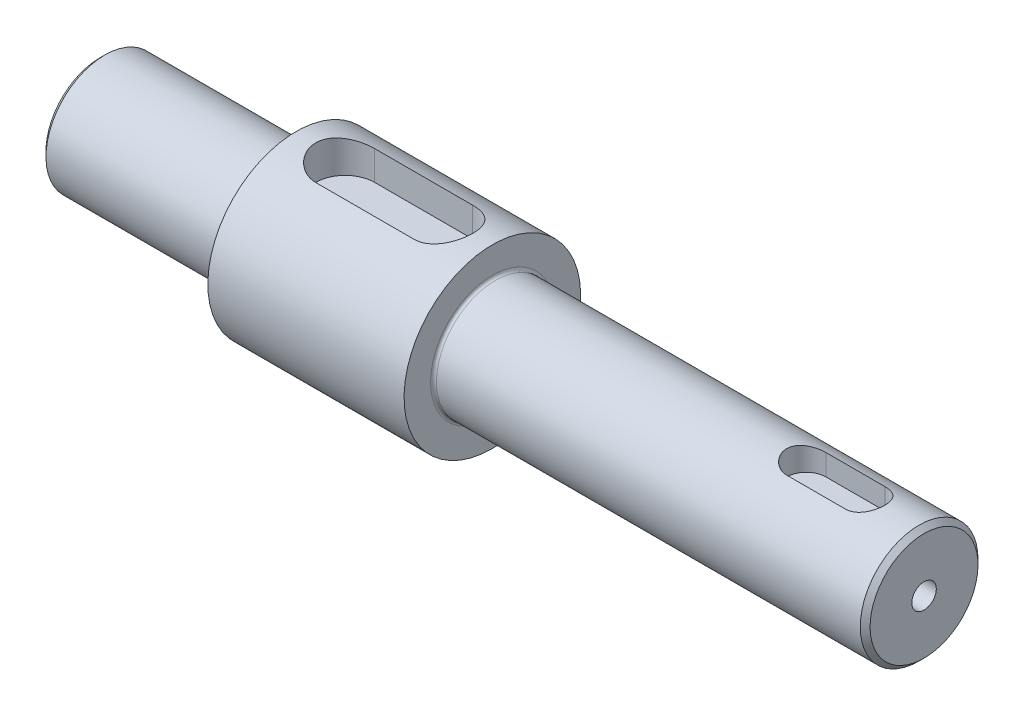
ISO-10303-21;
HEADER;
FILE_DESCRIPTION(('STEP AP214'),'2;1');
FILE_NAME('part.step','',(''),(''),'','','');
FILE_SCHEMA(('AUTOMOTIVE_DESIGN { 1 0 10303 214 1 1 1 1 }'));
ENDSEC;
DATA;
#1=APPLICATION_CONTEXT('core data for automotive mechanical design processes');
#2=APPLICATION_PROTOCOL_DEFINITION('international standard','automotive_design',2000,#1);
#3=PRODUCT_CONTEXT('',#1,'mechanical');
#4=PRODUCT('Part','Part','',(#3));
#5=PRODUCT_RELATED_PRODUCT_CATEGORY('part','',(#4));
#6=PRODUCT_DEFINITION_FORMATION('','',#4);
#7=PRODUCT_DEFINITION_CONTEXT('part definition',#1,'design');
#8=PRODUCT_DEFINITION('design','',#6,#7);
#9=PRODUCT_DEFINITION_SHAPE('','',#8);
#10=(LENGTH_UNIT() NAMED_UNIT(*) SI_UNIT(.MILLI.,.METRE.));
#11=(NAMED_UNIT(*) PLANE_ANGLE_UNIT() SI_UNIT($,.RADIAN.));
#12=(NAMED_UNIT(*) SI_UNIT($,.STERADIAN.) SOLID_ANGLE_UNIT());
#13=UNCERTAINTY_MEASURE_WITH_UNIT(LENGTH_MEASURE(1.E-05),#10,'distance_accuracy_value','');
#14=(GEOMETRIC_REPRESENTATION_CONTEXT(3) GLOBAL_UNCERTAINTY_ASSIGNED_CONTEXT((#13)) GLOBAL_UNIT_ASSIGNED_CONTEXT((#10,
#11,#12)) REPRESENTATION_CONTEXT('',''));
#15=CARTESIAN_POINT('',(0.,0.,0.));
#16=DIRECTION('',(0.,0.,1.));
#17=DIRECTION('',(1.,0.,0.));
#18=AXIS2_PLACEMENT_3D('',#15,#16,#17);
#19=CARTESIAN_POINT('',(-30.,0.,0.));
#20=DIRECTION('',(-1.,0.,0.));
#21=DIRECTION('',(0.,-1.,0.));
#22=AXIS2_PLACEMENT_3D('',#19,#20,#21);
#23=CYLINDRICAL_SURFACE('',#22,5.99999999999999);
#24=CARTESIAN_POINT('',(53.5,0.,0.));
#25=DIRECTION('',(1.,0.,0.));
#26=DIRECTION('',(0.,1.,0.));
#27=AXIS2_PLACEMENT_3D('',#24,#25,#26);
#28=CIRCLE('',#27,5.99999999999999);
#29=CARTESIAN_POINT('',(53.5,5.99999999999999,0.));
#30=VERTEX_POINT('',#29);
#31=EDGE_CURVE('E287',#30,#30,#28,.F.);
#32=ORIENTED_EDGE('',*,*,#31,.T.);
#33=EDGE_LOOP('',(#32));
#34=FACE_BOUND('',#33,.T.);
#35=CARTESIAN_POINT('',(10.3,0.,0.));
#36=DIRECTION('',(-1.,0.,0.));
#37=DIRECTION('',(0.,-1.,0.));
#38=AXIS2_PLACEMENT_3D('',#35,#36,#37);
#39=CIRCLE('',#38,5.99999999999999);
#40=CARTESIAN_POINT('',(10.3,-6.,0.));
#41=VERTEX_POINT('',#40);
#42=EDGE_CURVE('E291',#41,#41,#39,.F.);
#43=ORIENTED_EDGE('',*,*,#42,.T.);
#44=EDGE_LOOP('',(#43));
#45=FACE_BOUND('',#44,.T.);
#46=DIRECTION('',(-1.,0.,0.));
#47=VECTOR('',#46,1.);
#48=CARTESIAN_POINT('',(-30.,5.65685424949237,-1.99999999999998));
#49=LINE('',#48,#47);
#50=CARTESIAN_POINT('',(42.,5.65685424949238,-2.));
#51=VERTEX_POINT('',#50);
#52=CARTESIAN_POINT('',(48.,5.65685424949237,-2.));
#53=VERTEX_POINT('',#52);
#54=EDGE_CURVE('E293',#51,#53,#49,.F.);
#55=ORIENTED_EDGE('',*,*,#54,.T.);
#56=CARTESIAN_POINT('',(48.,5.65685424949237,-2.));
#57=CARTESIAN_POINT('',(48.0545809936022,5.65684884188677,-2.0000014949184));
#58=CARTESIAN_POINT('',(48.1091341243787,5.65764519886489,-1.99776424917479));
#59=CARTESIAN_POINT('',(48.2178171681098,5.66078654578441,-1.9888512140728));
#60=CARTESIAN_POINT('',(48.2719471913194,5.66313111768243,-1.98217662286705));
#61=CARTESIAN_POINT('',(48.4327842863903,5.67238184449301,-1.95562135046158));
#62=CARTESIAN_POINT('',(48.538361692541,5.68150584999029,-1.92920846605623));
#63=CARTESIAN_POINT('',(48.7432503848876,5.70456149397717,-1.85991682366086));
#64=CARTESIAN_POINT('',(48.8425650937458,5.71849047905858,-1.81704715197507));
#65=CARTESIAN_POINT('',(49.0326796680109,5.7495757443892,-1.71614645792974));
#66=CARTESIAN_POINT('',(49.1234742581347,5.76673400456216,-1.65810612564547));
#67=CARTESIAN_POINT('',(49.2974404626491,5.80308960804094,-1.52610278704603));
#68=CARTESIAN_POINT('',(49.3802297609252,5.82233755536617,-1.45164996064408));
#69=CARTESIAN_POINT('',(49.5324120355834,5.86027697385955,-1.28997688598297));
#70=CARTESIAN_POINT('',(49.6018026265119,5.87896834543705,-1.20275436910908));
#71=CARTESIAN_POINT('',(49.7269590376084,5.91427765988454,-1.01520729191253));
#72=CARTESIAN_POINT('',(49.7823219688045,5.93082875123707,-0.914600178716999));
#73=CARTESIAN_POINT('',(49.8751845033745,5.95939217209316,-0.704858499931724));
#74=CARTESIAN_POINT('',(49.9126895636409,5.97140588786618,-0.595726551186846));
#75=CARTESIAN_POINT('',(49.9674714521827,5.98918142285844,-0.37605869095608));
#76=CARTESIAN_POINT('',(49.9854065451074,5.99514617977146,-0.26570366892023));
#77=CARTESIAN_POINT('',(50.0026325970512,6.00087216807633,-0.043397938911351));
#78=CARTESIAN_POINT('',(50.0019279985395,6.00063487762604,0.0685523824907802));
#79=CARTESIAN_POINT('',(49.9823114337867,5.99412077270531,0.28620769055878));
#80=CARTESIAN_POINT('',(49.9641147240811,5.98808121982527,0.391985405251068));
#81=CARTESIAN_POINT('',(49.9112136026518,5.97093921001646,0.598888128753307));
#82=CARTESIAN_POINT('',(49.8765082755875,5.95983647235462,0.700012879232923));
#83=CARTESIAN_POINT('',(49.7911572607987,5.93351336542608,0.896305246061919));
#84=CARTESIAN_POINT('',(49.7403079097553,5.91824075676625,0.99137701130798));
#85=CARTESIAN_POINT('',(49.6242800972186,5.88516775360087,1.17184917819497));
#86=CARTESIAN_POINT('',(49.559097737907,5.86736667195186,1.25724693942936));
#87=CARTESIAN_POINT('',(49.4126579000063,5.83012543885478,1.42019467942242));
#88=CARTESIAN_POINT('',(49.3307889127806,5.81064757359828,1.49718722322539));
#89=CARTESIAN_POINT('',(49.1551170205677,5.77294980945702,1.63654404964076));
#90=CARTESIAN_POINT('',(49.0613102751935,5.75473031831506,1.69890360636762));
#91=CARTESIAN_POINT('',(48.8626396432934,5.72140062752634,1.80800665118556));
#92=CARTESIAN_POINT('',(48.7576329701341,5.70634029896468,1.85450601901536));
#93=CARTESIAN_POINT('',(48.5407060448201,5.68162194124077,1.92892046140223));
#94=CARTESIAN_POINT('',(48.4287970132557,5.67195538817985,1.95686487211071));
#95=CARTESIAN_POINT('',(48.263162726504,5.66273084189439,1.98331631256166));
#96=CARTESIAN_POINT('',(48.2107172202915,5.66053335389203,1.98957012251023));
#97=CARTESIAN_POINT('',(48.1055238432004,5.65759407142797,1.99790923214239));
#98=CARTESIAN_POINT('',(48.0527764509112,5.65685039859055,1.99999991078996));
#99=CARTESIAN_POINT('',(48.,5.65685424949237,2.));
#100=B_SPLINE_CURVE_WITH_KNOTS('',3,(#56,#57,#58,#59,#60,#61,#62,#63,#64,#65,#66,#67,#68,#69,
#70,#71,#72,#73,#74,#75,#76,#77,#78,#79,#80,#81,#82,#83,#84,#85,#86,#87,#88,#89,#90,#91,#92,#93,
#94,#95,#96,#97,#98,#99),.UNSPECIFIED.,.F.,.F.,(4,2,2,2,2,2,2,2,2,2,2,2,2,2,2,2,2,2,2,2,2,4),
(0.,0.163636969470867,0.327229772338919,0.653162396790742,0.978915321932481,1.30486862627062,
1.64233009925355,1.97985159727494,2.32618265866202,2.67240782242254,3.00658941454805,
3.34069136061284,3.6616883693147,3.98270317816495,4.30794037651935,4.63326613177537,
4.973881081161,5.31460588498484,5.6603605985608,6.00556734973678,6.16399790665503,
6.32222363058113),.UNSPECIFIED.);
#101=CARTESIAN_POINT('',(48.,5.65685424949237,2.));
#102=VERTEX_POINT('',#101);
#103=EDGE_CURVE('E237',#53,#102,#100,.T.);
#104=ORIENTED_EDGE('',*,*,#103,.T.);
#105=DIRECTION('',(-1.,0.,0.));
#106=VECTOR('',#105,1.);
#107=CARTESIAN_POINT('',(-30.,5.65685424949236,2.00000000000002));
#108=LINE('',#107,#106);
#109=CARTESIAN_POINT('',(42.,5.65685424949237,2.00000000000002));
#110=VERTEX_POINT('',#109);
#111=EDGE_CURVE('E298',#102,#110,#108,.T.);
#112=ORIENTED_EDGE('',*,*,#111,.T.);
#113=CARTESIAN_POINT('',(42.,5.65685424949237,2.));
#114=CARTESIAN_POINT('',(41.9454190063978,5.65684884188677,2.0000014949184));
#115=CARTESIAN_POINT('',(41.8908658756213,5.65764519886489,1.99776424917478));
#116=CARTESIAN_POINT('',(41.7821828318902,5.66078654578441,1.9888512140728));
#117=CARTESIAN_POINT('',(41.7280528086806,5.66313111768243,1.98217662286705));
#118=CARTESIAN_POINT('',(41.5672157136097,5.672381844493,1.95562135046158));
#119=CARTESIAN_POINT('',(41.461638307459,5.68150584999029,1.92920846605623));
#120=CARTESIAN_POINT('',(41.2567496151124,5.70456149397717,1.85991682366086));
#121=CARTESIAN_POINT('',(41.1574349062541,5.71849047905858,1.81704715197507));
#122=CARTESIAN_POINT('',(40.9673203319891,5.7495757443892,1.71614645792974));
#123=CARTESIAN_POINT('',(40.8765257418653,5.76673400456215,1.65810612564547));
#124=CARTESIAN_POINT('',(40.7025595373509,5.80308960804094,1.52610278704602));
#125=CARTESIAN_POINT('',(40.6197702390748,5.82233755536617,1.45164996064407));
#126=CARTESIAN_POINT('',(40.4675879644166,5.86027697385955,1.28997688598296));
#127=CARTESIAN_POINT('',(40.3981973734881,5.87896834543705,1.20275436910907));
#128=CARTESIAN_POINT('',(40.2730409623916,5.91427765988453,1.01520729191253));
#129=CARTESIAN_POINT('',(40.2176780311955,5.93082875123707,0.914600178716993));
#130=CARTESIAN_POINT('',(40.1248154966255,5.95939217209316,0.70485849993172));
#131=CARTESIAN_POINT('',(40.0873104363591,5.97140588786618,0.595726551186843));
#132=CARTESIAN_POINT('',(40.0325285478173,5.98918142285844,0.376058690956079));
#133=CARTESIAN_POINT('',(40.0145934548926,5.99514617977146,0.265703668920229));
#134=CARTESIAN_POINT('',(39.9973674029488,6.00087216807633,0.0433979389113502));
#135=CARTESIAN_POINT('',(39.9980720014605,6.00063487762604,-0.0685523824907809));
#136=CARTESIAN_POINT('',(40.0176885662133,5.99412077270531,-0.28620769055878));
#137=CARTESIAN_POINT('',(40.0358852759189,5.98808121982526,-0.391985405251069));
#138=CARTESIAN_POINT('',(40.0887863973482,5.97093921001646,-0.598888128753308));
#139=CARTESIAN_POINT('',(40.1234917244125,5.95983647235461,-0.700012879232923));
#140=CARTESIAN_POINT('',(40.2088427392013,5.93351336542608,-0.89630524606192));
#141=CARTESIAN_POINT('',(40.2596920902447,5.91824075676624,-0.991377011307981));
#142=CARTESIAN_POINT('',(40.3757199027814,5.88516775360087,-1.17184917819497));
#143=CARTESIAN_POINT('',(40.440902262093,5.86736667195186,-1.25724693942937));
#144=CARTESIAN_POINT('',(40.5873420999937,5.83012543885478,-1.42019467942242));
#145=CARTESIAN_POINT('',(40.6692110872194,5.81064757359827,-1.49718722322539));
#146=CARTESIAN_POINT('',(40.8448829794323,5.77294980945702,-1.63654404964076));
#147=CARTESIAN_POINT('',(40.9386897248065,5.75473031831506,-1.69890360636762));
#148=CARTESIAN_POINT('',(41.1373603567066,5.72140062752634,-1.80800665118556));
#149=CARTESIAN_POINT('',(41.2423670298659,5.70634029896468,-1.85450601901536));
#150=CARTESIAN_POINT('',(41.4592939551799,5.68162194124077,-1.92892046140223));
#151=CARTESIAN_POINT('',(41.5712029867443,5.67195538817985,-1.95686487211071));
#152=CARTESIAN_POINT('',(41.736837273496,5.66273084189439,-1.98331631256166));
#153=CARTESIAN_POINT('',(41.7892827797085,5.66053335389203,-1.98957012251023));
#154=CARTESIAN_POINT('',(41.8944761567996,5.65759407142797,-1.9979092321424));
#155=CARTESIAN_POINT('',(41.9472235490888,5.65685039859055,-1.99999991078996));
#156=CARTESIAN_POINT('',(42.,5.65685424949237,-2.));
#157=B_SPLINE_CURVE_WITH_KNOTS('',3,(#113,#114,#115,#116,#117,#118,#119,#120,#121,#122,#123,
#124,#125,#126,#127,#128,#129,#130,#131,#132,#133,#134,#135,#136,#137,#138,#139,#140,#141,#142,
#143,#144,#145,#146,#147,#148,#149,#150,#151,#152,#153,#154,#155,#156),.UNSPECIFIED.,.F.,.F.,(4,
2,2,2,2,2,2,2,2,2,2,2,2,2,2,2,2,2,2,2,2,4),(0.,0.163636969470867,0.327229772338919,
0.653162396790742,0.978915321932481,1.30486862627062,1.64233009925356,1.97985159727495,
2.32618265866202,2.67240782242254,3.00658941454805,3.34069136061284,3.6616883693147,
3.98270317816495,4.30794037651935,4.63326613177537,4.973881081161,5.31460588498484,
5.6603605985608,6.00556734973678,6.16399790665503,6.32222363058114),.UNSPECIFIED.);
#158=EDGE_CURVE('E60',#110,#51,#157,.T.);
#159=ORIENTED_EDGE('',*,*,#158,.T.);
#160=EDGE_LOOP('',(#55,#104,#112,#159));
#161=FACE_BOUND('',#160,.T.);
#162=ADVANCED_FACE('F43',(#34,#45,#161),#23,.T.);
#163=CARTESIAN_POINT('',(-30.,0.,0.));
#164=DIRECTION('',(-1.,0.,0.));
#165=DIRECTION('',(0.,-1.,0.));
#166=AXIS2_PLACEMENT_3D('',#163,#164,#165);
#167=CYLINDRICAL_SURFACE('',#166,9.00000000000001);
#168=CARTESIAN_POINT('',(9.99999999999999,0.,0.));
#169=DIRECTION('',(-1.,0.,0.));
#170=DIRECTION('',(0.,-1.,0.));
#171=AXIS2_PLACEMENT_3D('',#168,#169,#170);
#172=CIRCLE('',#171,9.00000000000001);
#173=CARTESIAN_POINT('',(10.,-9.00000000000001,0.));
#174=VERTEX_POINT('',#173);
#175=EDGE_CURVE('E185',#174,#174,#172,.T.);
#176=ORIENTED_EDGE('',*,*,#175,.T.);
#177=EDGE_LOOP('',(#176));
#178=FACE_BOUND('',#177,.T.);
#179=CARTESIAN_POINT('',(-10.,0.,0.));
#180=DIRECTION('',(-1.,0.,0.));
#181=DIRECTION('',(0.,-1.,0.));
#182=AXIS2_PLACEMENT_3D('',#179,#180,#181);
#183=CIRCLE('',#182,9.00000000000001);
#184=CARTESIAN_POINT('',(-10.,-9.00000000000001,0.));
#185=VERTEX_POINT('',#184);
#186=EDGE_CURVE('E189',#185,#185,#183,.T.);
#187=ORIENTED_EDGE('',*,*,#186,.F.);
#188=EDGE_LOOP('',(#187));
#189=FACE_BOUND('',#188,.T.);
#190=CARTESIAN_POINT('',(5.,8.48528137423857,3.));
#191=CARTESIAN_POINT('',(5.08184849338437,8.48526831927789,3.00001078932486));
#192=CARTESIAN_POINT('',(5.16368968961047,8.48646532685484,2.99665064665901));
#193=CARTESIAN_POINT('',(5.32673724601912,8.49118228945209,2.98327254936564));
#194=CARTESIAN_POINT('',(5.40794377158567,8.49470161740771,2.97325639196642));
#195=CARTESIAN_POINT('',(5.56890858602545,8.50395246303009,2.94668951307354));
#196=CARTESIAN_POINT('',(5.64867044306102,8.50967741820143,2.93015817315762));
#197=CARTESIAN_POINT('',(5.8064099222994,8.52315143887203,2.89073017236145));
#198=CARTESIAN_POINT('',(5.884387479908,8.53090057752398,2.8678332814324));
#199=CARTESIAN_POINT('',(6.11475389565729,8.55683928952694,2.7898986156743));
#200=CARTESIAN_POINT('',(6.26381498896268,8.5777349266086,2.72557700172275));
#201=CARTESIAN_POINT('',(6.54905217375737,8.62436440905027,2.57421340927529));
#202=CARTESIAN_POINT('',(6.68522028294121,8.65010122261302,2.4871574792233));
#203=CARTESIAN_POINT('',(6.9461514841598,8.70463418867365,2.28915595016086));
#204=CARTESIAN_POINT('',(7.07034217130225,8.73350627313643,2.17747541556634));
#205=CARTESIAN_POINT('',(7.29862052390004,8.79041552071283,1.93496485428979));
#206=CARTESIAN_POINT('',(7.40270460965604,8.81845253440363,1.80413142497752));
#207=CARTESIAN_POINT('',(7.5904378690398,8.87141647315469,1.52281106991367));
#208=CARTESIAN_POINT('',(7.67348276900678,8.8962431223892,1.37190030336069));
#209=CARTESIAN_POINT('',(7.81277693920547,8.9390882626048,1.05728771462316));
#210=CARTESIAN_POINT('',(7.86903439497087,8.95710883299482,0.893589817668315));
#211=CARTESIAN_POINT('',(7.95120713048677,8.98377213313374,0.564088045229082));
#212=CARTESIAN_POINT('',(7.9781098013917,8.99271926928152,0.398555505085334));
#213=CARTESIAN_POINT('',(8.00394891184228,9.00130825249011,0.065096906662415));
#214=CARTESIAN_POINT('',(8.00289201509874,9.00095231678789,-0.102828571762977));
#215=CARTESIAN_POINT('',(7.97346713406871,8.99118115872284,-0.429311537733993));
#216=CARTESIAN_POINT('',(7.94617203599392,8.98212182877037,-0.587978116884625));
#217=CARTESIAN_POINT('',(7.8668204541081,8.9564088159923,-0.898332184121466));
#218=CARTESIAN_POINT('',(7.81476259729548,8.93975471206725,-1.05001928471038));
#219=CARTESIAN_POINT('',(7.68673570486479,8.90027004455731,-1.34445790368095));
#220=CARTESIAN_POINT('',(7.61046116585584,8.8773611217211,-1.48706564697704));
#221=CARTESIAN_POINT('',(7.43642084479531,8.82775164383326,-1.75777363724201));
#222=CARTESIAN_POINT('',(7.33864921667593,8.80105005807909,-1.88586992347829));
#223=CARTESIAN_POINT('',(7.11898411754162,8.74518810577395,-2.13029252762404));
#224=CARTESIAN_POINT('',(6.99617294867562,8.71597116015319,-2.24578277403274));
#225=CARTESIAN_POINT('',(6.73268595470756,8.65942491449435,-2.4548141346411));
#226=CARTESIAN_POINT('',(6.59200438070759,8.63209622629495,-2.5483481578384));
#227=CARTESIAN_POINT('',(6.29391992176355,8.58210018141277,-2.71201733554396));
#228=CARTESIAN_POINT('',(6.1363008488814,8.55950759277136,-2.78178668333576));
#229=CARTESIAN_POINT('',(5.89231586544521,8.5316849132946,-2.86551808116445));
#230=CARTESIAN_POINT('',(5.80974324292977,8.5234226355907,-2.889939000529));
#231=CARTESIAN_POINT('',(5.64262960378963,8.50917513666655,-2.9316254907929));
#232=CARTESIAN_POINT('',(5.55808950466394,8.50318887578236,-2.94889432902107));
#233=CARTESIAN_POINT('',(5.39476672224939,8.49410161473166,-2.97496555991272));
#234=CARTESIAN_POINT('',(5.31608713936393,8.49080270505212,-2.98435073218189));
#235=CARTESIAN_POINT('',(5.15827447049512,8.48638843638537,-2.99686829404165));
#236=CARTESIAN_POINT('',(5.07914210235819,8.48527025982562,-3.0000087520931));
#237=CARTESIAN_POINT('',(5.,8.48528137423857,-3.));
#238=B_SPLINE_CURVE_WITH_KNOTS('',3,(#190,#191,#192,#193,#194,#195,#196,#197,#198,#199,#200,
#201,#202,#203,#204,#205,#206,#207,#208,#209,#210,#211,#212,#213,#214,#215,#216,#217,#218,#219,
#220,#221,#222,#223,#224,#225,#226,#227,#228,#229,#230,#231,#232,#233,#234,#235,#236,#237),
.UNSPECIFIED.,.F.,.F.,(4,2,2,2,2,2,2,2,2,2,2,2,2,2,2,2,2,2,2,2,2,2,2,4),(0.,0.245455454206298,
0.490844658508386,0.73550931531489,0.980182815366467,1.46881220307906,1.95774215958628,
2.46393436906068,2.97021661609277,3.48971320817339,4.00905095381417,4.51032334200243,
5.01147626109962,5.4929717741524,5.97449398742778,6.46234978495938,6.95033841784341,
7.46126084192186,7.97234804765762,8.49098011802155,8.75020549988895,9.00931232726959,
9.24695816264695,9.4842967485361),.UNSPECIFIED.);
#239=CARTESIAN_POINT('',(5.,8.48528137423857,3.));
#240=VERTEX_POINT('',#239);
#241=CARTESIAN_POINT('',(5.,8.48528137423857,-3.));
#242=VERTEX_POINT('',#241);
#243=EDGE_CURVE('E230',#240,#242,#238,.T.);
#244=ORIENTED_EDGE('',*,*,#243,.F.);
#245=DIRECTION('',(-1.,0.,0.));
#246=VECTOR('',#245,1.);
#247=CARTESIAN_POINT('',(-30.,8.48528137423857,3.00000000000001));
#248=LINE('',#247,#246);
#249=CARTESIAN_POINT('',(-5.,8.48528137423857,3.00000000000001));
#250=VERTEX_POINT('',#249);
#251=EDGE_CURVE('E193',#250,#240,#248,.F.);
#252=ORIENTED_EDGE('',*,*,#251,.F.);
#253=CARTESIAN_POINT('',(-5.,8.48528137423857,-3.));
#254=CARTESIAN_POINT('',(-5.08184849338437,8.48526831927789,-3.00001078932486));
#255=CARTESIAN_POINT('',(-5.16368968961046,8.48646532685483,-2.99665064665902));
#256=CARTESIAN_POINT('',(-5.32673724601911,8.49118228945209,-2.98327254936565));
#257=CARTESIAN_POINT('',(-5.40794377158567,8.49470161740771,-2.97325639196642));
#258=CARTESIAN_POINT('',(-5.56890858602545,8.50395246303008,-2.94668951307354));
#259=CARTESIAN_POINT('',(-5.64867044306102,8.50967741820142,-2.93015817315762));
#260=CARTESIAN_POINT('',(-5.8064099222994,8.52315143887203,-2.89073017236145));
#261=CARTESIAN_POINT('',(-5.884387479908,8.53090057752397,-2.86783328143241));
#262=CARTESIAN_POINT('',(-6.11475389565729,8.55683928952694,-2.7898986156743));
#263=CARTESIAN_POINT('',(-6.26381498896267,8.57773492660859,-2.72557700172276));
#264=CARTESIAN_POINT('',(-6.54905217375737,8.62436440905027,-2.5742134092753));
#265=CARTESIAN_POINT('',(-6.6852202829412,8.65010122261302,-2.4871574792233));
#266=CARTESIAN_POINT('',(-6.9461514841598,8.70463418867365,-2.28915595016086));
#267=CARTESIAN_POINT('',(-7.07034217130225,8.73350627313643,-2.17747541556635));
#268=CARTESIAN_POINT('',(-7.29862052390003,8.79041552071283,-1.93496485428979));
#269=CARTESIAN_POINT('',(-7.40270460965604,8.81845253440363,-1.80413142497752));
#270=CARTESIAN_POINT('',(-7.5904378690398,8.87141647315469,-1.52281106991368));
#271=CARTESIAN_POINT('',(-7.67348276900678,8.8962431223892,-1.37190030336069));
#272=CARTESIAN_POINT('',(-7.81277693920547,8.9390882626048,-1.05728771462316));
#273=CARTESIAN_POINT('',(-7.86903439497087,8.95710883299482,-0.893589817668319));
#274=CARTESIAN_POINT('',(-7.95120713048677,8.98377213313373,-0.564088045229086));
#275=CARTESIAN_POINT('',(-7.9781098013917,8.99271926928151,-0.398555505085338));
#276=CARTESIAN_POINT('',(-8.00394891184229,9.0013082524901,-0.06509690666242));
#277=CARTESIAN_POINT('',(-8.00289201509874,9.00095231678789,0.102828571762972));
#278=CARTESIAN_POINT('',(-7.97346713406871,8.99118115872284,0.429311537733988));
#279=CARTESIAN_POINT('',(-7.94617203599393,8.98212182877037,0.58797811688462));
#280=CARTESIAN_POINT('',(-7.8668204541081,8.9564088159923,0.898332184121461));
#281=CARTESIAN_POINT('',(-7.81476259729549,8.93975471206725,1.05001928471038));
#282=CARTESIAN_POINT('',(-7.68673570486479,8.90027004455731,1.34445790368094));
#283=CARTESIAN_POINT('',(-7.61046116585584,8.8773611217211,1.48706564697704));
#284=CARTESIAN_POINT('',(-7.43642084479531,8.82775164383326,1.75777363724201));
#285=CARTESIAN_POINT('',(-7.33864921667593,8.80105005807909,1.88586992347829));
#286=CARTESIAN_POINT('',(-7.11898411754162,8.74518810577395,2.13029252762403));
#287=CARTESIAN_POINT('',(-6.99617294867562,8.71597116015319,2.24578277403273));
#288=CARTESIAN_POINT('',(-6.73268595470756,8.65942491449435,2.45481413464109));
#289=CARTESIAN_POINT('',(-6.59200438070759,8.63209622629495,2.5483481578384));
#290=CARTESIAN_POINT('',(-6.29391992176356,8.58210018141277,2.71201733554396));
#291=CARTESIAN_POINT('',(-6.1363008488814,8.55950759277136,2.78178668333576));
#292=CARTESIAN_POINT('',(-5.89231586544521,8.5316849132946,2.86551808116445));
#293=CARTESIAN_POINT('',(-5.80974324292977,8.5234226355907,2.889939000529));
#294=CARTESIAN_POINT('',(-5.64262960378964,8.50917513666655,2.93162549079289));
#295=CARTESIAN_POINT('',(-5.55808950466395,8.50318887578236,2.94889432902107));
#296=CARTESIAN_POINT('',(-5.39476672224939,8.49410161473166,2.97496555991272));
#297=CARTESIAN_POINT('',(-5.31608713936393,8.49080270505212,2.98435073218189));
#298=CARTESIAN_POINT('',(-5.15827447049512,8.48638843638536,2.99686829404165));
#299=CARTESIAN_POINT('',(-5.07914210235819,8.48527025982562,3.00000875209309));
#300=CARTESIAN_POINT('',(-5.,8.48528137423857,3.));
#301=B_SPLINE_CURVE_WITH_KNOTS('',3,(#253,#254,#255,#256,#257,#258,#259,#260,#261,#262,#263,
#264,#265,#266,#267,#268,#269,#270,#271,#272,#273,#274,#275,#276,#277,#278,#279,#280,#281,#282,
#283,#284,#285,#286,#287,#288,#289,#290,#291,#292,#293,#294,#295,#296,#297,#298,#299,#300),
.UNSPECIFIED.,.F.,.F.,(4,2,2,2,2,2,2,2,2,2,2,2,2,2,2,2,2,2,2,2,2,2,2,4),(0.,0.245455454206298,
0.490844658508386,0.73550931531489,0.980182815366467,1.46881220307906,1.95774215958628,
2.46393436906068,2.97021661609277,3.48971320817339,4.00905095381416,4.51032334200243,
5.01147626109962,5.4929717741524,5.97449398742778,6.46234978495938,6.9503384178434,
7.46126084192185,7.97234804765762,8.49098011802155,8.75020549988895,9.00931232726958,
9.24695816264695,9.4842967485361),.UNSPECIFIED.);
#302=CARTESIAN_POINT('',(-5.,8.48528137423857,-3.));
#303=VERTEX_POINT('',#302);
#304=EDGE_CURVE('E196',#303,#250,#301,.T.);
#305=ORIENTED_EDGE('',*,*,#304,.F.);
#306=DIRECTION('',(-1.,0.,0.));
#307=VECTOR('',#306,1.);
#308=CARTESIAN_POINT('',(-30.,8.48528137423857,-2.99999999999999));
#309=LINE('',#308,#307);
#310=EDGE_CURVE('E205',#242,#303,#309,.T.);
#311=ORIENTED_EDGE('',*,*,#310,.F.);
#312=EDGE_LOOP('',(#244,#252,#305,#311));
#313=FACE_BOUND('',#312,.T.);
#314=ADVANCED_FACE('F207',(#178,#189,#313),#167,.T.);
#315=CARTESIAN_POINT('',(-30.,6.,0.));
#316=DIRECTION('',(1.,0.,0.));
#317=DIRECTION('',(0.,1.,0.));
#318=AXIS2_PLACEMENT_3D('',#315,#316,#317);
#319=PLANE('',#318);
#320=CARTESIAN_POINT('',(-30.,0.,0.));
#321=DIRECTION('',(1.,0.,0.));
#322=DIRECTION('',(0.,1.,0.));
#323=AXIS2_PLACEMENT_3D('',#320,#321,#322);
#324=CIRCLE('',#323,5.50000000000002);
#325=CARTESIAN_POINT('',(-30.,5.50000000000001,0.));
#326=VERTEX_POINT('',#325);
#327=EDGE_CURVE('E53',#326,#326,#324,.F.);
#328=ORIENTED_EDGE('',*,*,#327,.T.);
#329=EDGE_LOOP('',(#328));
#330=FACE_BOUND('',#329,.T.);
#331=ADVANCED_FACE('F282',(#330),#319,.F.);
#332=CARTESIAN_POINT('',(-30.,0.,0.));
#333=DIRECTION('',(-1.,0.,0.));
#334=DIRECTION('',(0.,-1.,0.));
#335=AXIS2_PLACEMENT_3D('',#332,#333,#334);
#336=CYLINDRICAL_SURFACE('',#335,6.00000000000001);
#337=CARTESIAN_POINT('',(-29.5,0.,0.));
#338=DIRECTION('',(1.,0.,0.));
#339=DIRECTION('',(0.,1.,0.));
#340=AXIS2_PLACEMENT_3D('',#337,#338,#339);
#341=CIRCLE('',#340,6.00000000000001);
#342=CARTESIAN_POINT('',(-29.5,6.,0.));
#343=VERTEX_POINT('',#342);
#344=EDGE_CURVE('E11',#343,#343,#341,.T.);
#345=ORIENTED_EDGE('',*,*,#344,.T.);
#346=EDGE_LOOP('',(#345));
#347=FACE_BOUND('',#346,.T.);
#348=CARTESIAN_POINT('',(-10.3,0.,0.));
#349=DIRECTION('',(1.,0.,0.));
#350=DIRECTION('',(0.,1.,0.));
#351=AXIS2_PLACEMENT_3D('',#348,#349,#350);
#352=CIRCLE('',#351,6.00000000000001);
#353=CARTESIAN_POINT('',(-10.3,6.,0.));
#354=VERTEX_POINT('',#353);
#355=EDGE_CURVE('E307',#354,#354,#352,.F.);
#356=ORIENTED_EDGE('',*,*,#355,.T.);
#357=EDGE_LOOP('',(#356));
#358=FACE_BOUND('',#357,.T.);
#359=ADVANCED_FACE('F335',(#347,#358),#336,.T.);
#360=CARTESIAN_POINT('',(-10.,9.,0.));
#361=DIRECTION('',(1.,0.,0.));
#362=DIRECTION('',(0.,1.,0.));
#363=AXIS2_PLACEMENT_3D('',#360,#361,#362);
#364=PLANE('',#363);
#365=CARTESIAN_POINT('',(-10.,0.,0.));
#366=DIRECTION('',(1.,0.,0.));
#367=DIRECTION('',(0.,1.,0.));
#368=AXIS2_PLACEMENT_3D('',#365,#366,#367);
#369=CIRCLE('',#368,6.30000000000001);
#370=CARTESIAN_POINT('',(-10.,6.3,0.));
#371=VERTEX_POINT('',#370);
#372=EDGE_CURVE('E311',#371,#371,#369,.T.);
#373=ORIENTED_EDGE('',*,*,#372,.T.);
#374=EDGE_LOOP('',(#373));
#375=FACE_BOUND('',#374,.T.);
#376=ORIENTED_EDGE('',*,*,#186,.T.);
#377=EDGE_LOOP('',(#376));
#378=FACE_BOUND('',#377,.T.);
#379=ADVANCED_FACE('F338',(#375,#378),#364,.F.);
#380=CARTESIAN_POINT('',(10.,9.,0.));
#381=DIRECTION('',(-1.,0.,0.));
#382=DIRECTION('',(0.,-1.,0.));
#383=AXIS2_PLACEMENT_3D('',#380,#381,#382);
#384=PLANE('',#383);
#385=CARTESIAN_POINT('',(10.,0.,0.));
#386=DIRECTION('',(-1.,0.,0.));
#387=DIRECTION('',(0.,-1.,0.));
#388=AXIS2_PLACEMENT_3D('',#385,#386,#387);
#389=CIRCLE('',#388,6.29999999999999);
#390=CARTESIAN_POINT('',(10.,-6.3,0.));
#391=VERTEX_POINT('',#390);
#392=EDGE_CURVE('E297',#391,#391,#389,.T.);
#393=ORIENTED_EDGE('',*,*,#392,.T.);
#394=EDGE_LOOP('',(#393));
#395=FACE_BOUND('',#394,.T.);
#396=ORIENTED_EDGE('',*,*,#175,.F.);
#397=EDGE_LOOP('',(#396));
#398=FACE_BOUND('',#397,.T.);
#399=ADVANCED_FACE('F227',(#395,#398),#384,.F.);
#400=CARTESIAN_POINT('',(5.,15.5,0.));
#401=DIRECTION('',(0.,-1.,0.));
#402=DIRECTION('',(0.,0.,-1.));
#403=AXIS2_PLACEMENT_3D('',#400,#401,#402);
#404=CYLINDRICAL_SURFACE('',#403,3.);
#405=ORIENTED_EDGE('',*,*,#243,.T.);
#406=DIRECTION('',(0.,-1.,0.));
#407=VECTOR('',#406,1.);
#408=CARTESIAN_POINT('',(5.,15.5,-3.));
#409=LINE('',#408,#407);
#410=CARTESIAN_POINT('',(5.,5.5,-3.));
#411=VERTEX_POINT('',#410);
#412=EDGE_CURVE('E182',#242,#411,#409,.T.);
#413=ORIENTED_EDGE('',*,*,#412,.T.);
#414=CARTESIAN_POINT('',(5.,5.5,0.));
#415=DIRECTION('',(0.,1.,0.));
#416=DIRECTION('',(0.,0.,1.));
#417=AXIS2_PLACEMENT_3D('',#414,#415,#416);
#418=CIRCLE('',#417,3.);
#419=CARTESIAN_POINT('',(5.,5.5,3.));
#420=VERTEX_POINT('',#419);
#421=EDGE_CURVE('E148',#420,#411,#418,.T.);
#422=ORIENTED_EDGE('',*,*,#421,.F.);
#423=DIRECTION('',(0.,-1.,0.));
#424=VECTOR('',#423,1.);
#425=CARTESIAN_POINT('',(5.,15.5,3.));
#426=LINE('',#425,#424);
#427=EDGE_CURVE('E174',#240,#420,#426,.T.);
#428=ORIENTED_EDGE('',*,*,#427,.F.);
#429=EDGE_LOOP('',(#405,#413,#422,#428));
#430=FACE_BOUND('',#429,.T.);
#431=ADVANCED_FACE('F222',(#430),#404,.F.);
#432=CARTESIAN_POINT('',(5.,15.5,-3.));
#433=DIRECTION('',(0.,0.,1.));
#434=DIRECTION('',(1.,0.,0.));
#435=AXIS2_PLACEMENT_3D('',#432,#433,#434);
#436=PLANE('',#435);
#437=ORIENTED_EDGE('',*,*,#310,.T.);
#438=DIRECTION('',(0.,-1.,0.));
#439=VECTOR('',#438,1.);
#440=CARTESIAN_POINT('',(-5.,15.5,-3.));
#441=LINE('',#440,#439);
#442=CARTESIAN_POINT('',(-5.,5.5,-3.));
#443=VERTEX_POINT('',#442);
#444=EDGE_CURVE('E179',#303,#443,#441,.T.);
#445=ORIENTED_EDGE('',*,*,#444,.T.);
#446=DIRECTION('',(-1.,0.,0.));
#447=VECTOR('',#446,1.);
#448=CARTESIAN_POINT('',(5.,5.5,-3.));
#449=LINE('',#448,#447);
#450=EDGE_CURVE('E162',#411,#443,#449,.T.);
#451=ORIENTED_EDGE('',*,*,#450,.F.);
#452=ORIENTED_EDGE('',*,*,#412,.F.);
#453=EDGE_LOOP('',(#437,#445,#451,#452));
#454=FACE_BOUND('',#453,.T.);
#455=ADVANCED_FACE('F217',(#454),#436,.T.);
#456=CARTESIAN_POINT('',(-5.,15.5,0.));
#457=DIRECTION('',(0.,-1.,0.));
#458=DIRECTION('',(0.,0.,-1.));
#459=AXIS2_PLACEMENT_3D('',#456,#457,#458);
#460=CYLINDRICAL_SURFACE('',#459,3.);
#461=ORIENTED_EDGE('',*,*,#304,.T.);
#462=DIRECTION('',(0.,-1.,0.));
#463=VECTOR('',#462,1.);
#464=CARTESIAN_POINT('',(-5.,15.5,3.));
#465=LINE('',#464,#463);
#466=CARTESIAN_POINT('',(-5.,5.5,3.));
#467=VERTEX_POINT('',#466);
#468=EDGE_CURVE('E68',#250,#467,#465,.T.);
#469=ORIENTED_EDGE('',*,*,#468,.T.);
#470=CARTESIAN_POINT('',(-5.,5.5,0.));
#471=DIRECTION('',(0.,1.,0.));
#472=DIRECTION('',(0.,0.,1.));
#473=AXIS2_PLACEMENT_3D('',#470,#471,#472);
#474=CIRCLE('',#473,3.);
#475=EDGE_CURVE('E166',#443,#467,#474,.T.);
#476=ORIENTED_EDGE('',*,*,#475,.F.);
#477=ORIENTED_EDGE('',*,*,#444,.F.);
#478=EDGE_LOOP('',(#461,#469,#476,#477));
#479=FACE_BOUND('',#478,.T.);
#480=ADVANCED_FACE('F211',(#479),#460,.F.);
#481=CARTESIAN_POINT('',(5.,15.5,3.));
#482=DIRECTION('',(0.,0.,-1.));
#483=DIRECTION('',(-1.,0.,0.));
#484=AXIS2_PLACEMENT_3D('',#481,#482,#483);
#485=PLANE('',#484);
#486=ORIENTED_EDGE('',*,*,#251,.T.);
#487=ORIENTED_EDGE('',*,*,#427,.T.);
#488=DIRECTION('',(1.,0.,0.));
#489=VECTOR('',#488,1.);
#490=CARTESIAN_POINT('',(5.,5.5,3.));
#491=LINE('',#490,#489);
#492=EDGE_CURVE('E170',#467,#420,#491,.T.);
#493=ORIENTED_EDGE('',*,*,#492,.F.);
#494=ORIENTED_EDGE('',*,*,#468,.F.);
#495=EDGE_LOOP('',(#486,#487,#493,#494));
#496=FACE_BOUND('',#495,.T.);
#497=ADVANCED_FACE('F216',(#496),#485,.T.);
#498=CARTESIAN_POINT('',(5.,5.5,0.));
#499=DIRECTION('',(0.,1.,0.));
#500=DIRECTION('',(0.,0.,1.));
#501=AXIS2_PLACEMENT_3D('',#498,#499,#500);
#502=PLANE('',#501);
#503=ORIENTED_EDGE('',*,*,#421,.T.);
#504=ORIENTED_EDGE('',*,*,#450,.T.);
#505=ORIENTED_EDGE('',*,*,#475,.T.);
#506=ORIENTED_EDGE('',*,*,#492,.T.);
#507=EDGE_LOOP('',(#503,#504,#505,#506));
#508=FACE_BOUND('',#507,.T.);
#509=ADVANCED_FACE('F270',(#508),#502,.T.);
#510=CARTESIAN_POINT('',(54.,0.,0.));
#511=DIRECTION('',(1.,0.,0.));
#512=DIRECTION('',(0.,1.,0.));
#513=AXIS2_PLACEMENT_3D('',#510,#511,#512);
#514=PLANE('',#513);
#515=CARTESIAN_POINT('',(54.,0.,0.));
#516=DIRECTION('',(1.,0.,0.));
#517=DIRECTION('',(0.,0.,-1.));
#518=AXIS2_PLACEMENT_3D('',#515,#516,#517);
#519=CIRCLE('',#518,1.25);
#520=CARTESIAN_POINT('',(54.,0.,-1.25));
#521=VERTEX_POINT('',#520);
#522=EDGE_CURVE('E123',#521,#521,#519,.T.);
#523=ORIENTED_EDGE('',*,*,#522,.F.);
#524=EDGE_LOOP('',(#523));
#525=FACE_BOUND('',#524,.T.);
#526=CARTESIAN_POINT('',(54.,0.,0.));
#527=DIRECTION('',(1.,0.,0.));
#528=DIRECTION('',(0.,1.,0.));
#529=AXIS2_PLACEMENT_3D('',#526,#527,#528);
#530=CIRCLE('',#529,5.49999999999998);
#531=CARTESIAN_POINT('',(54.,5.49999999999998,0.));
#532=VERTEX_POINT('',#531);
#533=EDGE_CURVE('E315',#532,#532,#530,.T.);
#534=ORIENTED_EDGE('',*,*,#533,.T.);
#535=EDGE_LOOP('',(#534));
#536=FACE_BOUND('',#535,.T.);
#537=ADVANCED_FACE('F268',(#525,#536),#514,.T.);
#538=CARTESIAN_POINT('',(42.,3.5,0.));
#539=DIRECTION('',(0.,1.,0.));
#540=DIRECTION('',(0.,0.,1.));
#541=AXIS2_PLACEMENT_3D('',#538,#539,#540);
#542=CYLINDRICAL_SURFACE('',#541,2.);
#543=DIRECTION('',(0.,1.,0.));
#544=VECTOR('',#543,1.);
#545=CARTESIAN_POINT('',(42.,3.5,2.));
#546=LINE('',#545,#544);
#547=CARTESIAN_POINT('',(42.,3.5,2.));
#548=VERTEX_POINT('',#547);
#549=EDGE_CURVE('E144',#548,#110,#546,.T.);
#550=ORIENTED_EDGE('',*,*,#549,.F.);
#551=CARTESIAN_POINT('',(42.,3.5,0.));
#552=DIRECTION('',(0.,1.,0.));
#553=DIRECTION('',(0.,0.,1.));
#554=AXIS2_PLACEMENT_3D('',#551,#552,#553);
#555=CIRCLE('',#554,2.);
#556=CARTESIAN_POINT('',(42.,3.5,-2.));
#557=VERTEX_POINT('',#556);
#558=EDGE_CURVE('E122',#557,#548,#555,.T.);
#559=ORIENTED_EDGE('',*,*,#558,.F.);
#560=DIRECTION('',(0.,1.,0.));
#561=VECTOR('',#560,1.);
#562=CARTESIAN_POINT('',(42.,3.5,-2.));
#563=LINE('',#562,#561);
#564=EDGE_CURVE('E145',#557,#51,#563,.T.);
#565=ORIENTED_EDGE('',*,*,#564,.T.);
#566=ORIENTED_EDGE('',*,*,#158,.F.);
#567=EDGE_LOOP('',(#550,#559,#565,#566));
#568=FACE_BOUND('',#567,.T.);
#569=ADVANCED_FACE('F264',(#568),#542,.F.);
#570=CARTESIAN_POINT('',(42.,3.5,-2.));
#571=DIRECTION('',(0.,0.,-1.));
#572=DIRECTION('',(-1.,0.,0.));
#573=AXIS2_PLACEMENT_3D('',#570,#571,#572);
#574=PLANE('',#573);
#575=ORIENTED_EDGE('',*,*,#564,.F.);
#576=DIRECTION('',(-1.,0.,0.));
#577=VECTOR('',#576,1.);
#578=CARTESIAN_POINT('',(42.,3.5,-2.));
#579=LINE('',#578,#577);
#580=CARTESIAN_POINT('',(48.,3.5,-2.));
#581=VERTEX_POINT('',#580);
#582=EDGE_CURVE('E140',#581,#557,#579,.T.);
#583=ORIENTED_EDGE('',*,*,#582,.F.);
#584=DIRECTION('',(0.,1.,0.));
#585=VECTOR('',#584,1.);
#586=CARTESIAN_POINT('',(48.,3.5,-2.));
#587=LINE('',#586,#585);
#588=EDGE_CURVE('E149',#581,#53,#587,.T.);
#589=ORIENTED_EDGE('',*,*,#588,.T.);
#590=ORIENTED_EDGE('',*,*,#54,.F.);
#591=EDGE_LOOP('',(#575,#583,#589,#590));
#592=FACE_BOUND('',#591,.T.);
#593=ADVANCED_FACE('F258',(#592),#574,.F.);
#594=CARTESIAN_POINT('',(48.,3.5,0.));
#595=DIRECTION('',(0.,1.,0.));
#596=DIRECTION('',(0.,0.,1.));
#597=AXIS2_PLACEMENT_3D('',#594,#595,#596);
#598=CYLINDRICAL_SURFACE('',#597,2.);
#599=ORIENTED_EDGE('',*,*,#588,.F.);
#600=CARTESIAN_POINT('',(48.,3.5,0.));
#601=DIRECTION('',(0.,1.,0.));
#602=DIRECTION('',(0.,0.,1.));
#603=AXIS2_PLACEMENT_3D('',#600,#601,#602);
#604=CIRCLE('',#603,2.);
#605=CARTESIAN_POINT('',(48.,3.5,2.));
#606=VERTEX_POINT('',#605);
#607=EDGE_CURVE('E136',#606,#581,#604,.T.);
#608=ORIENTED_EDGE('',*,*,#607,.F.);
#609=DIRECTION('',(0.,1.,0.));
#610=VECTOR('',#609,1.);
#611=CARTESIAN_POINT('',(48.,3.5,2.));
#612=LINE('',#611,#610);
#613=EDGE_CURVE('E153',#606,#102,#612,.T.);
#614=ORIENTED_EDGE('',*,*,#613,.T.);
#615=ORIENTED_EDGE('',*,*,#103,.F.);
#616=EDGE_LOOP('',(#599,#608,#614,#615));
#617=FACE_BOUND('',#616,.T.);
#618=ADVANCED_FACE('F252',(#617),#598,.F.);
#619=CARTESIAN_POINT('',(42.,3.5,2.));
#620=DIRECTION('',(0.,0.,1.));
#621=DIRECTION('',(1.,0.,0.));
#622=AXIS2_PLACEMENT_3D('',#619,#620,#621);
#623=PLANE('',#622);
#624=ORIENTED_EDGE('',*,*,#613,.F.);
#625=DIRECTION('',(1.,0.,0.));
#626=VECTOR('',#625,1.);
#627=CARTESIAN_POINT('',(42.,3.5,2.));
#628=LINE('',#627,#626);
#629=EDGE_CURVE('E128',#548,#606,#628,.T.);
#630=ORIENTED_EDGE('',*,*,#629,.F.);
#631=ORIENTED_EDGE('',*,*,#549,.T.);
#632=ORIENTED_EDGE('',*,*,#111,.F.);
#633=EDGE_LOOP('',(#624,#630,#631,#632));
#634=FACE_BOUND('',#633,.T.);
#635=ADVANCED_FACE('F257',(#634),#623,.F.);
#636=CARTESIAN_POINT('',(42.,3.5,0.));
#637=DIRECTION('',(0.,1.,0.));
#638=DIRECTION('',(0.,0.,1.));
#639=AXIS2_PLACEMENT_3D('',#636,#637,#638);
#640=PLANE('',#639);
#641=ORIENTED_EDGE('',*,*,#558,.T.);
#642=ORIENTED_EDGE('',*,*,#629,.T.);
#643=ORIENTED_EDGE('',*,*,#607,.T.);
#644=ORIENTED_EDGE('',*,*,#582,.T.);
#645=EDGE_LOOP('',(#641,#642,#643,#644));
#646=FACE_BOUND('',#645,.T.);
#647=ADVANCED_FACE('F262',(#646),#640,.T.);
#648=CARTESIAN_POINT('',(10.3,0.,0.));
#649=DIRECTION('',(-1.,0.,0.));
#650=DIRECTION('',(0.,-1.,0.));
#651=AXIS2_PLACEMENT_3D('',#648,#649,#650);
#652=TOROIDAL_SURFACE('',#651,6.29999999999999,0.3);
#653=ORIENTED_EDGE('',*,*,#42,.F.);
#654=EDGE_LOOP('',(#653));
#655=FACE_BOUND('',#654,.T.);
#656=ORIENTED_EDGE('',*,*,#392,.F.);
#657=EDGE_LOOP('',(#656));
#658=FACE_BOUND('',#657,.T.);
#659=ADVANCED_FACE('F343',(#655,#658),#652,.F.);
#660=CARTESIAN_POINT('',(-10.3,0.,0.));
#661=DIRECTION('',(1.,0.,0.));
#662=DIRECTION('',(0.,1.,0.));
#663=AXIS2_PLACEMENT_3D('',#660,#661,#662);
#664=TOROIDAL_SURFACE('',#663,6.30000000000001,0.3);
#665=ORIENTED_EDGE('',*,*,#372,.F.);
#666=EDGE_LOOP('',(#665));
#667=FACE_BOUND('',#666,.T.);
#668=ORIENTED_EDGE('',*,*,#355,.F.);
#669=EDGE_LOOP('',(#668));
#670=FACE_BOUND('',#669,.T.);
#671=ADVANCED_FACE('F331',(#667,#670),#664,.F.);
#672=CARTESIAN_POINT('',(54.,0.,0.));
#673=DIRECTION('',(-1.,0.,0.));
#674=DIRECTION('',(0.,-1.,0.));
#675=AXIS2_PLACEMENT_3D('',#672,#673,#674);
#676=CONICAL_SURFACE('',#675,5.49999999999999,0.785398163397452);
#677=ORIENTED_EDGE('',*,*,#31,.F.);
#678=EDGE_LOOP('',(#677));
#679=FACE_BOUND('',#678,.T.);
#680=ORIENTED_EDGE('',*,*,#533,.F.);
#681=EDGE_LOOP('',(#680));
#682=FACE_BOUND('',#681,.T.);
#683=ADVANCED_FACE('F326',(#679,#682),#676,.T.);
#684=CARTESIAN_POINT('',(-30.,0.,0.));
#685=DIRECTION('',(1.,0.,0.));
#686=DIRECTION('',(0.,1.,0.));
#687=AXIS2_PLACEMENT_3D('',#684,#685,#686);
#688=CONICAL_SURFACE('',#687,5.50000000000002,0.785398163397441);
#689=ORIENTED_EDGE('',*,*,#344,.F.);
#690=EDGE_LOOP('',(#689));
#691=FACE_BOUND('',#690,.T.);
#692=ORIENTED_EDGE('',*,*,#327,.F.);
#693=EDGE_LOOP('',(#692));
#694=FACE_BOUND('',#693,.T.);
#695=ADVANCED_FACE('F46',(#691,#694),#688,.T.);
#696=CARTESIAN_POINT('',(47.2510757737845,0.,0.));
#697=DIRECTION('',(1.,0.,0.));
#698=DIRECTION('',(0.,0.,-1.));
#699=AXIS2_PLACEMENT_3D('',#696,#697,#698);
#700=CONICAL_SURFACE('',#699,1.25,1.02974425867665);
#701=CARTESIAN_POINT('',(46.5,0.,0.));
#702=VERTEX_POINT('',#701);
#703=VERTEX_LOOP('',#702);
#704=FACE_BOUND('',#703,.T.);
#705=CARTESIAN_POINT('',(47.2510757737845,0.,0.));
#706=DIRECTION('',(1.,0.,0.));
#707=DIRECTION('',(0.,0.,-1.));
#708=AXIS2_PLACEMENT_3D('',#705,#706,#707);
#709=CIRCLE('',#708,1.25);
#710=CARTESIAN_POINT('',(47.2510757737845,0.,-1.25));
#711=VERTEX_POINT('',#710);
#712=EDGE_CURVE('E119',#711,#711,#709,.T.);
#713=ORIENTED_EDGE('',*,*,#712,.T.);
#714=EDGE_LOOP('',(#713));
#715=FACE_BOUND('',#714,.T.);
#716=ADVANCED_FACE('F112',(#704,#715),#700,.F.);
#717=CARTESIAN_POINT('',(54.,0.,0.));
#718=DIRECTION('',(1.,0.,0.));
#719=DIRECTION('',(0.,0.,-1.));
#720=AXIS2_PLACEMENT_3D('',#717,#718,#719);
#721=CYLINDRICAL_SURFACE('',#720,1.25);
#722=ORIENTED_EDGE('',*,*,#712,.F.);
#723=EDGE_LOOP('',(#722));
#724=FACE_BOUND('',#723,.T.);
#725=ORIENTED_EDGE('',*,*,#522,.T.);
#726=EDGE_LOOP('',(#725));
#727=FACE_BOUND('',#726,.T.);
#728=ADVANCED_FACE('F115',(#724,#727),#721,.F.);
#729=CLOSED_SHELL('',(#162,#314,#331,#359,#379,#399,#431,#455,#480,#497,#509,#537,#569,#593,
#618,#635,#647,#659,#671,#683,#695,#716,#728));
#730=MANIFOLD_SOLID_BREP('B2',#729);
#731=ADVANCED_BREP_SHAPE_REPRESENTATION('',(#18,#730),#14);
#732=SHAPE_DEFINITION_REPRESENTATION(#9,#731);
ENDSEC;
END-ISO-10303-21;
